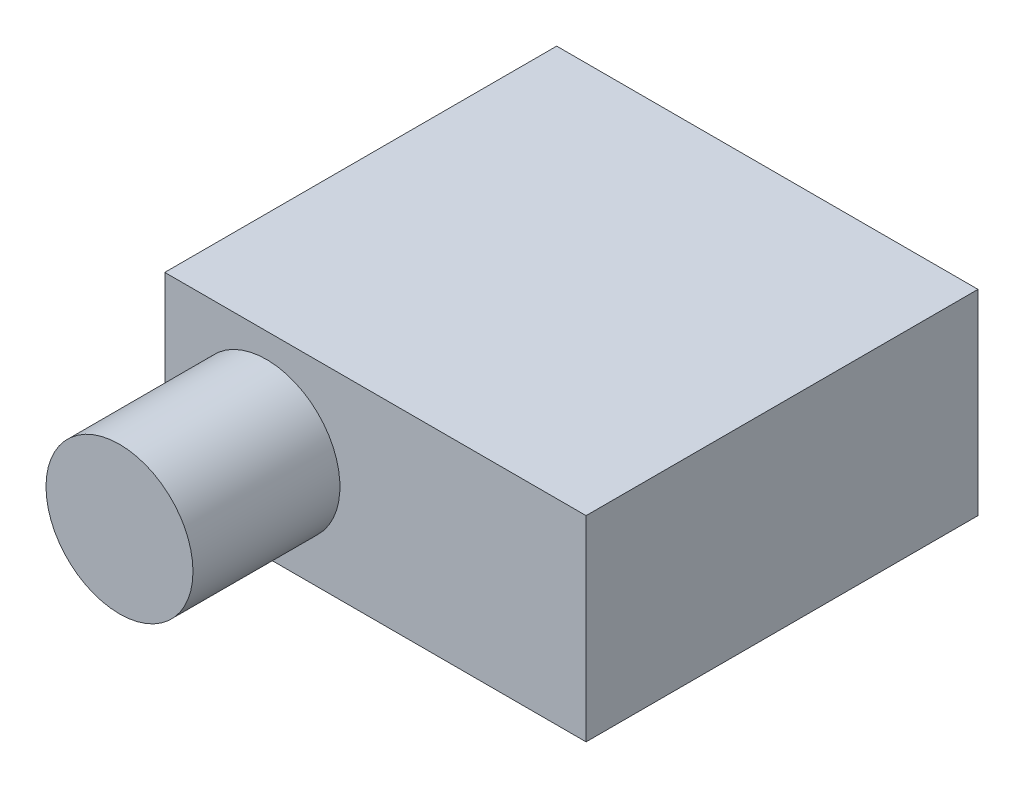
ISO-10303-21;
HEADER;
FILE_DESCRIPTION(('STEP AP214'),'2;1');
FILE_NAME('part.step','',(''),(''),'','','');
FILE_SCHEMA(('AUTOMOTIVE_DESIGN { 1 0 10303 214 1 1 1 1 }'));
ENDSEC;
DATA;
#1=APPLICATION_CONTEXT('core data for automotive mechanical design processes');
#2=APPLICATION_PROTOCOL_DEFINITION('international standard','automotive_design',2000,#1);
#3=PRODUCT_CONTEXT('',#1,'mechanical');
#4=PRODUCT('Part','Part','',(#3));
#5=PRODUCT_RELATED_PRODUCT_CATEGORY('part','',(#4));
#6=PRODUCT_DEFINITION_FORMATION('','',#4);
#7=PRODUCT_DEFINITION_CONTEXT('part definition',#1,'design');
#8=PRODUCT_DEFINITION('design','',#6,#7);
#9=PRODUCT_DEFINITION_SHAPE('','',#8);
#10=(LENGTH_UNIT() NAMED_UNIT(*) SI_UNIT(.MILLI.,.METRE.));
#11=(NAMED_UNIT(*) PLANE_ANGLE_UNIT() SI_UNIT($,.RADIAN.));
#12=(NAMED_UNIT(*) SI_UNIT($,.STERADIAN.) SOLID_ANGLE_UNIT());
#13=UNCERTAINTY_MEASURE_WITH_UNIT(LENGTH_MEASURE(1.E-05),#10,'distance_accuracy_value','');
#14=(GEOMETRIC_REPRESENTATION_CONTEXT(3) GLOBAL_UNCERTAINTY_ASSIGNED_CONTEXT((#13)) GLOBAL_UNIT_ASSIGNED_CONTEXT((#10,
#11,#12)) REPRESENTATION_CONTEXT('',''));
#15=CARTESIAN_POINT('',(0.,0.,0.));
#16=DIRECTION('',(0.,0.,1.));
#17=DIRECTION('',(1.,0.,0.));
#18=AXIS2_PLACEMENT_3D('',#15,#16,#17);
#19=CARTESIAN_POINT('',(0.,0.,40.));
#20=DIRECTION('',(0.,0.,-1.));
#21=DIRECTION('',(-1.,0.,0.));
#22=AXIS2_PLACEMENT_3D('',#19,#20,#21);
#23=PLANE('',#22);
#24=DIRECTION('',(0.,1.,0.));
#25=VECTOR('',#24,1.);
#26=CARTESIAN_POINT('',(21.5,-10.,40.));
#27=LINE('',#26,#25);
#28=CARTESIAN_POINT('',(21.5,-10.,40.));
#29=VERTEX_POINT('',#28);
#30=CARTESIAN_POINT('',(21.5,10.,40.));
#31=VERTEX_POINT('',#30);
#32=EDGE_CURVE('E86',#29,#31,#27,.T.);
#33=ORIENTED_EDGE('',*,*,#32,.T.);
#34=DIRECTION('',(-1.,0.,0.));
#35=VECTOR('',#34,1.);
#36=CARTESIAN_POINT('',(-21.5,10.,40.));
#37=LINE('',#36,#35);
#38=CARTESIAN_POINT('',(-21.5,10.,40.));
#39=VERTEX_POINT('',#38);
#40=EDGE_CURVE('E81',#31,#39,#37,.T.);
#41=ORIENTED_EDGE('',*,*,#40,.T.);
#42=DIRECTION('',(0.,-1.,0.));
#43=VECTOR('',#42,1.);
#44=CARTESIAN_POINT('',(-21.5,-10.,40.));
#45=LINE('',#44,#43);
#46=CARTESIAN_POINT('',(-21.5,-10.,40.));
#47=VERTEX_POINT('',#46);
#48=EDGE_CURVE('E84',#39,#47,#45,.T.);
#49=ORIENTED_EDGE('',*,*,#48,.T.);
#50=DIRECTION('',(1.,0.,0.));
#51=VECTOR('',#50,1.);
#52=CARTESIAN_POINT('',(-21.5,-10.,40.));
#53=LINE('',#52,#51);
#54=EDGE_CURVE('E50',#47,#29,#53,.T.);
#55=ORIENTED_EDGE('',*,*,#54,.T.);
#56=EDGE_LOOP('',(#33,#41,#49,#55));
#57=FACE_BOUND('',#56,.T.);
#58=CARTESIAN_POINT('',(-11.12225515456,0.,40.));
#59=DIRECTION('',(0.,0.,-1.));
#60=DIRECTION('',(-1.,0.,0.));
#61=AXIS2_PLACEMENT_3D('',#58,#59,#60);
#62=CIRCLE('',#61,7.5);
#63=CARTESIAN_POINT('',(-18.6222551545601,0.,40.));
#64=VERTEX_POINT('',#63);
#65=EDGE_CURVE('E11',#64,#64,#62,.F.);
#66=ORIENTED_EDGE('',*,*,#65,.F.);
#67=EDGE_LOOP('',(#66));
#68=FACE_BOUND('',#67,.T.);
#69=ADVANCED_FACE('F33',(#57,#68),#23,.F.);
#70=CARTESIAN_POINT('',(21.5,-10.,40.));
#71=DIRECTION('',(-1.,0.,0.));
#72=DIRECTION('',(0.,0.,1.));
#73=AXIS2_PLACEMENT_3D('',#70,#71,#72);
#74=PLANE('',#73);
#75=DIRECTION('',(0.,1.,0.));
#76=VECTOR('',#75,1.);
#77=CARTESIAN_POINT('',(21.5,-10.,0.));
#78=LINE('',#77,#76);
#79=CARTESIAN_POINT('',(21.5,-10.,0.));
#80=VERTEX_POINT('',#79);
#81=CARTESIAN_POINT('',(21.5,10.,0.));
#82=VERTEX_POINT('',#81);
#83=EDGE_CURVE('E100',#80,#82,#78,.T.);
#84=ORIENTED_EDGE('',*,*,#83,.T.);
#85=DIRECTION('',(0.,0.,-1.));
#86=VECTOR('',#85,1.);
#87=CARTESIAN_POINT('',(21.5,10.,40.));
#88=LINE('',#87,#86);
#89=EDGE_CURVE('E42',#31,#82,#88,.T.);
#90=ORIENTED_EDGE('',*,*,#89,.F.);
#91=ORIENTED_EDGE('',*,*,#32,.F.);
#92=DIRECTION('',(0.,0.,-1.));
#93=VECTOR('',#92,1.);
#94=CARTESIAN_POINT('',(21.5,-10.,40.));
#95=LINE('',#94,#93);
#96=EDGE_CURVE('E96',#29,#80,#95,.T.);
#97=ORIENTED_EDGE('',*,*,#96,.T.);
#98=EDGE_LOOP('',(#84,#90,#91,#97));
#99=FACE_BOUND('',#98,.T.);
#100=ADVANCED_FACE('F35',(#99),#74,.F.);
#101=CARTESIAN_POINT('',(-21.5,10.,40.));
#102=DIRECTION('',(0.,-1.,0.));
#103=DIRECTION('',(0.,0.,-1.));
#104=AXIS2_PLACEMENT_3D('',#101,#102,#103);
#105=PLANE('',#104);
#106=DIRECTION('',(-1.,0.,0.));
#107=VECTOR('',#106,1.);
#108=CARTESIAN_POINT('',(-21.5,10.,0.));
#109=LINE('',#108,#107);
#110=CARTESIAN_POINT('',(-21.5,10.,0.));
#111=VERTEX_POINT('',#110);
#112=EDGE_CURVE('E91',#82,#111,#109,.T.);
#113=ORIENTED_EDGE('',*,*,#112,.T.);
#114=DIRECTION('',(0.,0.,-1.));
#115=VECTOR('',#114,1.);
#116=CARTESIAN_POINT('',(-21.5,10.,40.));
#117=LINE('',#116,#115);
#118=EDGE_CURVE('E89',#39,#111,#117,.T.);
#119=ORIENTED_EDGE('',*,*,#118,.F.);
#120=ORIENTED_EDGE('',*,*,#40,.F.);
#121=ORIENTED_EDGE('',*,*,#89,.T.);
#122=EDGE_LOOP('',(#113,#119,#120,#121));
#123=FACE_BOUND('',#122,.T.);
#124=ADVANCED_FACE('F90',(#123),#105,.F.);
#125=CARTESIAN_POINT('',(-21.5,-10.,40.));
#126=DIRECTION('',(1.,0.,0.));
#127=DIRECTION('',(0.,0.,-1.));
#128=AXIS2_PLACEMENT_3D('',#125,#126,#127);
#129=PLANE('',#128);
#130=DIRECTION('',(0.,-1.,0.));
#131=VECTOR('',#130,1.);
#132=CARTESIAN_POINT('',(-21.5,-10.,0.));
#133=LINE('',#132,#131);
#134=CARTESIAN_POINT('',(-21.5,-10.,0.));
#135=VERTEX_POINT('',#134);
#136=EDGE_CURVE('E67',#111,#135,#133,.T.);
#137=ORIENTED_EDGE('',*,*,#136,.T.);
#138=DIRECTION('',(0.,0.,-1.));
#139=VECTOR('',#138,1.);
#140=CARTESIAN_POINT('',(-21.5,-10.,40.));
#141=LINE('',#140,#139);
#142=EDGE_CURVE('E92',#47,#135,#141,.T.);
#143=ORIENTED_EDGE('',*,*,#142,.F.);
#144=ORIENTED_EDGE('',*,*,#48,.F.);
#145=ORIENTED_EDGE('',*,*,#118,.T.);
#146=EDGE_LOOP('',(#137,#143,#144,#145));
#147=FACE_BOUND('',#146,.T.);
#148=ADVANCED_FACE('F94',(#147),#129,.F.);
#149=CARTESIAN_POINT('',(-21.5,-10.,40.));
#150=DIRECTION('',(0.,1.,0.));
#151=DIRECTION('',(0.,0.,1.));
#152=AXIS2_PLACEMENT_3D('',#149,#150,#151);
#153=PLANE('',#152);
#154=DIRECTION('',(1.,0.,0.));
#155=VECTOR('',#154,1.);
#156=CARTESIAN_POINT('',(-21.5,-10.,0.));
#157=LINE('',#156,#155);
#158=EDGE_CURVE('E73',#135,#80,#157,.T.);
#159=ORIENTED_EDGE('',*,*,#158,.T.);
#160=ORIENTED_EDGE('',*,*,#96,.F.);
#161=ORIENTED_EDGE('',*,*,#54,.F.);
#162=ORIENTED_EDGE('',*,*,#142,.T.);
#163=EDGE_LOOP('',(#159,#160,#161,#162));
#164=FACE_BOUND('',#163,.T.);
#165=ADVANCED_FACE('F114',(#164),#153,.F.);
#166=CARTESIAN_POINT('',(0.,0.,0.));
#167=DIRECTION('',(0.,0.,-1.));
#168=DIRECTION('',(-1.,0.,0.));
#169=AXIS2_PLACEMENT_3D('',#166,#167,#168);
#170=PLANE('',#169);
#171=ORIENTED_EDGE('',*,*,#83,.F.);
#172=ORIENTED_EDGE('',*,*,#158,.F.);
#173=ORIENTED_EDGE('',*,*,#136,.F.);
#174=ORIENTED_EDGE('',*,*,#112,.F.);
#175=EDGE_LOOP('',(#171,#172,#173,#174));
#176=FACE_BOUND('',#175,.T.);
#177=ADVANCED_FACE('F111',(#176),#170,.T.);
#178=CARTESIAN_POINT('',(-11.12225515456,0.,55.));
#179=DIRECTION('',(0.,0.,-1.));
#180=DIRECTION('',(-1.,0.,0.));
#181=AXIS2_PLACEMENT_3D('',#178,#179,#180);
#182=CYLINDRICAL_SURFACE('',#181,7.5);
#183=CARTESIAN_POINT('',(-11.12225515456,0.,55.));
#184=DIRECTION('',(0.,0.,1.));
#185=DIRECTION('',(1.,0.,0.));
#186=AXIS2_PLACEMENT_3D('',#183,#184,#185);
#187=CIRCLE('',#186,7.5);
#188=CARTESIAN_POINT('',(-3.62225515456005,0.,55.));
#189=VERTEX_POINT('',#188);
#190=EDGE_CURVE('E103',#189,#189,#187,.T.);
#191=ORIENTED_EDGE('',*,*,#190,.F.);
#192=EDGE_LOOP('',(#191));
#193=FACE_BOUND('',#192,.T.);
#194=ORIENTED_EDGE('',*,*,#65,.T.);
#195=EDGE_LOOP('',(#194));
#196=FACE_BOUND('',#195,.T.);
#197=ADVANCED_FACE('F113',(#193,#196),#182,.T.);
#198=CARTESIAN_POINT('',(-11.12225515456,0.,55.));
#199=DIRECTION('',(0.,0.,1.));
#200=DIRECTION('',(1.,0.,0.));
#201=AXIS2_PLACEMENT_3D('',#198,#199,#200);
#202=PLANE('',#201);
#203=ORIENTED_EDGE('',*,*,#190,.T.);
#204=EDGE_LOOP('',(#203));
#205=FACE_BOUND('',#204,.T.);
#206=ADVANCED_FACE('F121',(#205),#202,.T.);
#207=CLOSED_SHELL('',(#69,#100,#124,#148,#165,#177,#197,#206));
#208=MANIFOLD_SOLID_BREP('B2',#207);
#209=ADVANCED_BREP_SHAPE_REPRESENTATION('',(#18,#208),#14);
#210=SHAPE_DEFINITION_REPRESENTATION(#9,#209);
ENDSEC;
END-ISO-10303-21;
